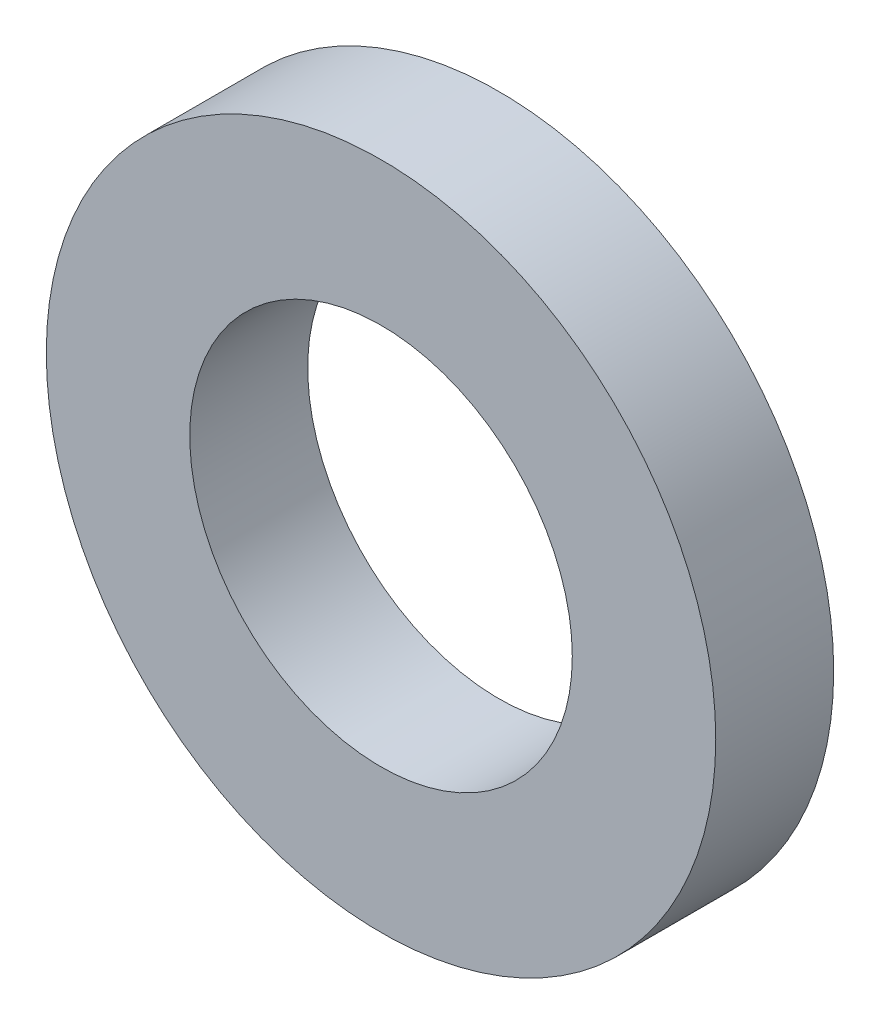
ISO-10303-21;
HEADER;
FILE_DESCRIPTION(('STEP AP214'),'2;1');
FILE_NAME('part.step','',(''),(''),'','','');
FILE_SCHEMA(('AUTOMOTIVE_DESIGN { 1 0 10303 214 1 1 1 1 }'));
ENDSEC;
DATA;
#1=APPLICATION_CONTEXT('core data for automotive mechanical design processes');
#2=APPLICATION_PROTOCOL_DEFINITION('international standard','automotive_design',2000,#1);
#3=PRODUCT_CONTEXT('',#1,'mechanical');
#4=PRODUCT('Part','Part','',(#3));
#5=PRODUCT_RELATED_PRODUCT_CATEGORY('part','',(#4));
#6=PRODUCT_DEFINITION_FORMATION('','',#4);
#7=PRODUCT_DEFINITION_CONTEXT('part definition',#1,'design');
#8=PRODUCT_DEFINITION('design','',#6,#7);
#9=PRODUCT_DEFINITION_SHAPE('','',#8);
#10=(LENGTH_UNIT() NAMED_UNIT(*) SI_UNIT(.MILLI.,.METRE.));
#11=(NAMED_UNIT(*) PLANE_ANGLE_UNIT() SI_UNIT($,.RADIAN.));
#12=(NAMED_UNIT(*) SI_UNIT($,.STERADIAN.) SOLID_ANGLE_UNIT());
#13=UNCERTAINTY_MEASURE_WITH_UNIT(LENGTH_MEASURE(1.E-05),#10,'distance_accuracy_value','');
#14=(GEOMETRIC_REPRESENTATION_CONTEXT(3) GLOBAL_UNCERTAINTY_ASSIGNED_CONTEXT((#13)) GLOBAL_UNIT_ASSIGNED_CONTEXT((#10,
#11,#12)) REPRESENTATION_CONTEXT('',''));
#15=CARTESIAN_POINT('',(0.,0.,0.));
#16=DIRECTION('',(0.,0.,1.));
#17=DIRECTION('',(1.,0.,0.));
#18=AXIS2_PLACEMENT_3D('',#15,#16,#17);
#19=CARTESIAN_POINT('',(0.,8.25,1.85));
#20=DIRECTION('',(0.,0.,1.));
#21=DIRECTION('',(1.,0.,0.));
#22=AXIS2_PLACEMENT_3D('',#19,#20,#21);
#23=PLANE('',#22);
#24=CARTESIAN_POINT('',(0.,0.,1.85));
#25=DIRECTION('',(0.,0.,1.));
#26=DIRECTION('',(1.,0.,0.));
#27=AXIS2_PLACEMENT_3D('',#24,#25,#26);
#28=CIRCLE('',#27,6.);
#29=CARTESIAN_POINT('',(6.,0.,1.85));
#30=VERTEX_POINT('',#29);
#31=EDGE_CURVE('E17',#30,#30,#28,.F.);
#32=ORIENTED_EDGE('',*,*,#31,.T.);
#33=EDGE_LOOP('',(#32));
#34=FACE_BOUND('',#33,.T.);
#35=CARTESIAN_POINT('',(0.,0.,1.85));
#36=DIRECTION('',(0.,0.,1.));
#37=DIRECTION('',(1.,0.,0.));
#38=AXIS2_PLACEMENT_3D('',#35,#36,#37);
#39=CIRCLE('',#38,10.5);
#40=CARTESIAN_POINT('',(10.5,0.,1.85));
#41=VERTEX_POINT('',#40);
#42=EDGE_CURVE('E26',#41,#41,#39,.F.);
#43=ORIENTED_EDGE('',*,*,#42,.F.);
#44=EDGE_LOOP('',(#43));
#45=FACE_BOUND('',#44,.T.);
#46=ADVANCED_FACE('F14',(#34,#45),#23,.T.);
#47=CARTESIAN_POINT('',(0.,0.,0.));
#48=DIRECTION('',(0.,0.,1.));
#49=DIRECTION('',(1.,0.,0.));
#50=AXIS2_PLACEMENT_3D('',#47,#48,#49);
#51=CYLINDRICAL_SURFACE('',#50,6.);
#52=ORIENTED_EDGE('',*,*,#31,.F.);
#53=EDGE_LOOP('',(#52));
#54=FACE_BOUND('',#53,.T.);
#55=CARTESIAN_POINT('',(0.,0.,-1.85));
#56=DIRECTION('',(0.,0.,1.));
#57=DIRECTION('',(1.,0.,0.));
#58=AXIS2_PLACEMENT_3D('',#55,#56,#57);
#59=CIRCLE('',#58,6.);
#60=CARTESIAN_POINT('',(6.,0.,-1.85));
#61=VERTEX_POINT('',#60);
#62=EDGE_CURVE('E21',#61,#61,#59,.T.);
#63=ORIENTED_EDGE('',*,*,#62,.F.);
#64=EDGE_LOOP('',(#63));
#65=FACE_BOUND('',#64,.T.);
#66=ADVANCED_FACE('F36',(#54,#65),#51,.F.);
#67=CARTESIAN_POINT('',(0.,0.,0.));
#68=DIRECTION('',(0.,0.,1.));
#69=DIRECTION('',(1.,0.,0.));
#70=AXIS2_PLACEMENT_3D('',#67,#68,#69);
#71=CYLINDRICAL_SURFACE('',#70,10.5);
#72=CARTESIAN_POINT('',(0.,0.,-1.85));
#73=DIRECTION('',(0.,0.,1.));
#74=DIRECTION('',(1.,0.,0.));
#75=AXIS2_PLACEMENT_3D('',#72,#73,#74);
#76=CIRCLE('',#75,10.5);
#77=CARTESIAN_POINT('',(10.5,0.,-1.85));
#78=VERTEX_POINT('',#77);
#79=EDGE_CURVE('E9',#78,#78,#76,.F.);
#80=ORIENTED_EDGE('',*,*,#79,.F.);
#81=EDGE_LOOP('',(#80));
#82=FACE_BOUND('',#81,.T.);
#83=ORIENTED_EDGE('',*,*,#42,.T.);
#84=EDGE_LOOP('',(#83));
#85=FACE_BOUND('',#84,.T.);
#86=ADVANCED_FACE('F39',(#82,#85),#71,.T.);
#87=CARTESIAN_POINT('',(0.,8.25,-1.85));
#88=DIRECTION('',(0.,0.,-1.));
#89=DIRECTION('',(-1.,0.,0.));
#90=AXIS2_PLACEMENT_3D('',#87,#88,#89);
#91=PLANE('',#90);
#92=ORIENTED_EDGE('',*,*,#79,.T.);
#93=EDGE_LOOP('',(#92));
#94=FACE_BOUND('',#93,.T.);
#95=ORIENTED_EDGE('',*,*,#62,.T.);
#96=EDGE_LOOP('',(#95));
#97=FACE_BOUND('',#96,.T.);
#98=ADVANCED_FACE('F42',(#94,#97),#91,.T.);
#99=CLOSED_SHELL('',(#46,#66,#86,#98));
#100=MANIFOLD_SOLID_BREP('B1',#99);
#101=ADVANCED_BREP_SHAPE_REPRESENTATION('',(#18,#100),#14);
#102=SHAPE_DEFINITION_REPRESENTATION(#9,#101);
ENDSEC;
END-ISO-10303-21;
